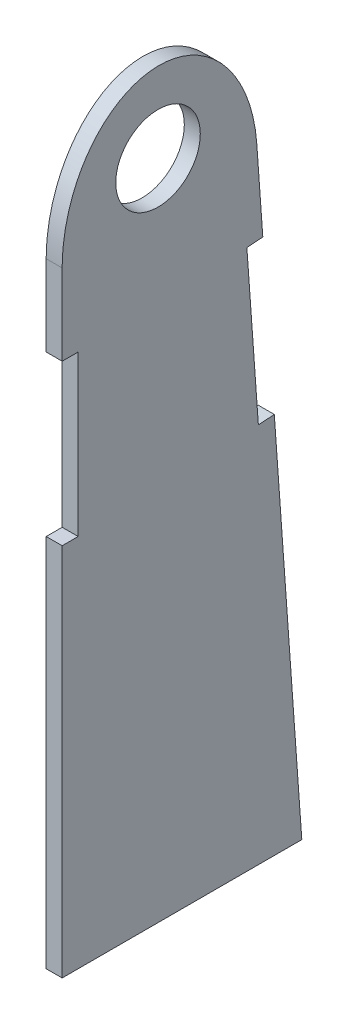
ISO-10303-21;
HEADER;
FILE_DESCRIPTION(('STEP AP214'),'2;1');
FILE_NAME('part.step','',(''),(''),'','','');
FILE_SCHEMA(('AUTOMOTIVE_DESIGN { 1 0 10303 214 1 1 1 1 }'));
ENDSEC;
DATA;
#1=APPLICATION_CONTEXT('core data for automotive mechanical design processes');
#2=APPLICATION_PROTOCOL_DEFINITION('international standard','automotive_design',2000,#1);
#3=PRODUCT_CONTEXT('',#1,'mechanical');
#4=PRODUCT('Part','Part','',(#3));
#5=PRODUCT_RELATED_PRODUCT_CATEGORY('part','',(#4));
#6=PRODUCT_DEFINITION_FORMATION('','',#4);
#7=PRODUCT_DEFINITION_CONTEXT('part definition',#1,'design');
#8=PRODUCT_DEFINITION('design','',#6,#7);
#9=PRODUCT_DEFINITION_SHAPE('','',#8);
#10=(LENGTH_UNIT() NAMED_UNIT(*) SI_UNIT(.MILLI.,.METRE.));
#11=(NAMED_UNIT(*) PLANE_ANGLE_UNIT() SI_UNIT($,.RADIAN.));
#12=(NAMED_UNIT(*) SI_UNIT($,.STERADIAN.) SOLID_ANGLE_UNIT());
#13=UNCERTAINTY_MEASURE_WITH_UNIT(LENGTH_MEASURE(1.E-05),#10,'distance_accuracy_value','');
#14=(GEOMETRIC_REPRESENTATION_CONTEXT(3) GLOBAL_UNCERTAINTY_ASSIGNED_CONTEXT((#13)) GLOBAL_UNIT_ASSIGNED_CONTEXT((#10,
#11,#12)) REPRESENTATION_CONTEXT('',''));
#15=CARTESIAN_POINT('',(0.,0.,0.));
#16=DIRECTION('',(0.,0.,1.));
#17=DIRECTION('',(1.,0.,0.));
#18=AXIS2_PLACEMENT_3D('',#15,#16,#17);
#19=CARTESIAN_POINT('',(1.5875,0.,0.));
#20=DIRECTION('',(1.,0.,0.));
#21=DIRECTION('',(0.,0.,-1.));
#22=AXIS2_PLACEMENT_3D('',#19,#20,#21);
#23=PLANE('',#22);
#24=CARTESIAN_POINT('',(1.5875,0.,0.));
#25=DIRECTION('',(1.,0.,0.));
#26=DIRECTION('',(0.,0.,-1.));
#27=AXIS2_PLACEMENT_3D('',#24,#25,#26);
#28=CIRCLE('',#27,4.2);
#29=CARTESIAN_POINT('',(1.5875,0.,-4.2));
#30=VERTEX_POINT('',#29);
#31=EDGE_CURVE('E240',#30,#30,#28,.T.);
#32=ORIENTED_EDGE('',*,*,#31,.F.);
#33=EDGE_LOOP('',(#32));
#34=FACE_BOUND('',#33,.T.);
#35=DIRECTION('',(0.,0.997415809527486,0.0718449922028656));
#36=VECTOR('',#35,1.);
#37=CARTESIAN_POINT('',(1.5875,0.684323550732295,-9.50038558574931));
#38=LINE('',#37,#36);
#39=CARTESIAN_POINT('',(1.5875,-11.9828572302668,-10.4128169867257));
#40=VERTEX_POINT('',#39);
#41=CARTESIAN_POINT('',(1.5875,-3.65835279360995,-9.81319348905159));
#42=VERTEX_POINT('',#41);
#43=EDGE_CURVE('E189',#40,#42,#38,.T.);
#44=ORIENTED_EDGE('',*,*,#43,.T.);
#45=CARTESIAN_POINT('',(1.5875,-4.7625,-0.165572585401585));
#46=DIRECTION('',(1.,0.,0.));
#47=DIRECTION('',(0.,0.999915026390816,0.0130361036300332));
#48=AXIS2_PLACEMENT_3D('',#45,#46,#47);
#49=ELLIPSE('',#48,12.701079256545,9.68998139284341);
#50=CARTESIAN_POINT('',(1.5875,-4.67180966686049,9.52500000000001));
#51=VERTEX_POINT('',#50);
#52=EDGE_CURVE('E248',#42,#51,#49,.T.);
#53=ORIENTED_EDGE('',*,*,#52,.T.);
#54=DIRECTION('',(0.,1.,0.));
#55=VECTOR('',#54,1.);
#56=CARTESIAN_POINT('',(1.5875,0.,9.525));
#57=LINE('',#56,#55);
#58=CARTESIAN_POINT('',(1.5875,-12.7,9.52500000000002));
#59=VERTEX_POINT('',#58);
#60=EDGE_CURVE('E226',#59,#51,#57,.T.);
#61=ORIENTED_EDGE('',*,*,#60,.F.);
#62=DIRECTION('',(0.,0.,-1.));
#63=VECTOR('',#62,1.);
#64=CARTESIAN_POINT('',(1.5875,-12.7,0.));
#65=LINE('',#64,#63);
#66=CARTESIAN_POINT('',(1.5875,-12.7,7.93750000000001));
#67=VERTEX_POINT('',#66);
#68=EDGE_CURVE('E222',#59,#67,#65,.T.);
#69=ORIENTED_EDGE('',*,*,#68,.T.);
#70=DIRECTION('',(0.,1.,0.));
#71=VECTOR('',#70,1.);
#72=CARTESIAN_POINT('',(1.5875,0.,7.93749999999998));
#73=LINE('',#72,#71);
#74=CARTESIAN_POINT('',(1.5875,-28.575,7.93750000000005));
#75=VERTEX_POINT('',#74);
#76=EDGE_CURVE('E206',#75,#67,#73,.T.);
#77=ORIENTED_EDGE('',*,*,#76,.F.);
#78=DIRECTION('',(0.,0.,-1.));
#79=VECTOR('',#78,1.);
#80=CARTESIAN_POINT('',(1.5875,-28.575,0.));
#81=LINE('',#80,#79);
#82=CARTESIAN_POINT('',(1.5875,-28.575,9.52500000000005));
#83=VERTEX_POINT('',#82);
#84=EDGE_CURVE('E218',#83,#75,#81,.T.);
#85=ORIENTED_EDGE('',*,*,#84,.F.);
#86=CARTESIAN_POINT('',(1.5875,-65.7746383391697,9.52500000000011));
#87=VERTEX_POINT('',#86);
#88=EDGE_CURVE('E224',#87,#83,#57,.T.);
#89=ORIENTED_EDGE('',*,*,#88,.F.);
#90=DIRECTION('',(0.,0.,1.));
#91=VECTOR('',#90,1.);
#92=CARTESIAN_POINT('',(1.5875,-65.7746383391697,0.));
#93=LINE('',#92,#91);
#94=CARTESIAN_POINT('',(1.5875,-65.7746383391697,-14.2875));
#95=VERTEX_POINT('',#94);
#96=EDGE_CURVE('E229',#95,#87,#93,.T.);
#97=ORIENTED_EDGE('',*,*,#96,.F.);
#98=CARTESIAN_POINT('',(1.5875,-27.8168332065156,-11.5533562379462));
#99=VERTEX_POINT('',#98);
#100=EDGE_CURVE('E141',#95,#99,#38,.T.);
#101=ORIENTED_EDGE('',*,*,#100,.T.);
#102=DIRECTION('',(0.,-0.0718449922028648,0.997415809527486));
#103=VECTOR('',#102,1.);
#104=CARTESIAN_POINT('',(1.5875,-28.5011567572479,-2.05297065219686));
#105=LINE('',#104,#103);
#106=CARTESIAN_POINT('',(1.5875,-27.9308871316377,-9.96995864032131));
#107=VERTEX_POINT('',#106);
#108=EDGE_CURVE('E132',#99,#107,#105,.T.);
#109=ORIENTED_EDGE('',*,*,#108,.T.);
#110=DIRECTION('',(0.,0.997415809527486,0.0718449922028657));
#111=VECTOR('',#110,1.);
#112=CARTESIAN_POINT('',(1.5875,0.570269625610247,-7.91698798812442));
#113=LINE('',#112,#111);
#114=CARTESIAN_POINT('',(1.5875,-12.0969111553888,-8.82941938910081));
#115=VERTEX_POINT('',#114);
#116=EDGE_CURVE('E137',#107,#115,#113,.T.);
#117=ORIENTED_EDGE('',*,*,#116,.T.);
#118=DIRECTION('',(0.,-0.0718449922028669,0.997415809527486));
#119=VECTOR('',#118,1.);
#120=CARTESIAN_POINT('',(1.5875,-12.6671807809991,-0.91243140097641));
#121=LINE('',#120,#119);
#122=EDGE_CURVE('E158',#40,#115,#121,.T.);
#123=ORIENTED_EDGE('',*,*,#122,.F.);
#124=EDGE_LOOP('',(#44,#53,#61,#69,#77,#85,#89,#97,#101,#109,#117,#123));
#125=FACE_BOUND('',#124,.T.);
#126=ADVANCED_FACE('F40',(#34,#125),#23,.T.);
#127=CARTESIAN_POINT('',(0.,0.,0.));
#128=DIRECTION('',(1.,0.,0.));
#129=DIRECTION('',(0.,0.,-1.));
#130=AXIS2_PLACEMENT_3D('',#127,#128,#129);
#131=PLANE('',#130);
#132=CARTESIAN_POINT('',(0.,0.,0.));
#133=DIRECTION('',(1.,0.,0.));
#134=DIRECTION('',(0.,0.,-1.));
#135=AXIS2_PLACEMENT_3D('',#132,#133,#134);
#136=CIRCLE('',#135,4.2);
#137=CARTESIAN_POINT('',(0.,0.,-4.2));
#138=VERTEX_POINT('',#137);
#139=EDGE_CURVE('E166',#138,#138,#136,.T.);
#140=ORIENTED_EDGE('',*,*,#139,.T.);
#141=EDGE_LOOP('',(#140));
#142=FACE_BOUND('',#141,.T.);
#143=CARTESIAN_POINT('',(0.,-4.7625,-0.165572585401585));
#144=DIRECTION('',(1.,0.,0.));
#145=DIRECTION('',(0.,0.999915026390816,0.0130361036300332));
#146=AXIS2_PLACEMENT_3D('',#143,#144,#145);
#147=ELLIPSE('',#146,12.701079256545,9.68998139284341);
#148=CARTESIAN_POINT('',(0.,-3.65835279360995,-9.81319348905159));
#149=VERTEX_POINT('',#148);
#150=CARTESIAN_POINT('',(0.,-4.67180966686049,9.52500000000001));
#151=VERTEX_POINT('',#150);
#152=EDGE_CURVE('E245',#149,#151,#147,.T.);
#153=ORIENTED_EDGE('',*,*,#152,.F.);
#154=DIRECTION('',(0.,0.997415809527486,0.0718449922028656));
#155=VECTOR('',#154,1.);
#156=CARTESIAN_POINT('',(0.,0.684323550732295,-9.50038558574931));
#157=LINE('',#156,#155);
#158=CARTESIAN_POINT('',(0.,-11.9828572302668,-10.4128169867257));
#159=VERTEX_POINT('',#158);
#160=EDGE_CURVE('E163',#159,#149,#157,.T.);
#161=ORIENTED_EDGE('',*,*,#160,.F.);
#162=DIRECTION('',(0.,-0.0718449922028669,0.997415809527486));
#163=VECTOR('',#162,1.);
#164=CARTESIAN_POINT('',(0.,-12.6671807809991,-0.91243140097641));
#165=LINE('',#164,#163);
#166=CARTESIAN_POINT('',(0.,-12.0969111553888,-8.82941938910081));
#167=VERTEX_POINT('',#166);
#168=EDGE_CURVE('E186',#159,#167,#165,.T.);
#169=ORIENTED_EDGE('',*,*,#168,.T.);
#170=DIRECTION('',(0.,0.997415809527486,0.0718449922028657));
#171=VECTOR('',#170,1.);
#172=CARTESIAN_POINT('',(0.,0.570269625610247,-7.91698798812442));
#173=LINE('',#172,#171);
#174=CARTESIAN_POINT('',(0.,-27.9308871316377,-9.96995864032131));
#175=VERTEX_POINT('',#174);
#176=EDGE_CURVE('E184',#175,#167,#173,.T.);
#177=ORIENTED_EDGE('',*,*,#176,.F.);
#178=DIRECTION('',(0.,-0.0718449922028648,0.997415809527486));
#179=VECTOR('',#178,1.);
#180=CARTESIAN_POINT('',(0.,-28.5011567572479,-2.05297065219686));
#181=LINE('',#180,#179);
#182=CARTESIAN_POINT('',(0.,-27.8168332065156,-11.5533562379462));
#183=VERTEX_POINT('',#182);
#184=EDGE_CURVE('E150',#183,#175,#181,.T.);
#185=ORIENTED_EDGE('',*,*,#184,.F.);
#186=CARTESIAN_POINT('',(0.,-65.7746383391697,-14.2875));
#187=VERTEX_POINT('',#186);
#188=EDGE_CURVE('E167',#187,#183,#157,.T.);
#189=ORIENTED_EDGE('',*,*,#188,.F.);
#190=DIRECTION('',(0.,0.,1.));
#191=VECTOR('',#190,1.);
#192=CARTESIAN_POINT('',(0.,-65.7746383391697,0.));
#193=LINE('',#192,#191);
#194=CARTESIAN_POINT('',(0.,-65.7746383391697,9.52500000000011));
#195=VERTEX_POINT('',#194);
#196=EDGE_CURVE('E180',#187,#195,#193,.T.);
#197=ORIENTED_EDGE('',*,*,#196,.T.);
#198=DIRECTION('',(0.,1.,0.));
#199=VECTOR('',#198,1.);
#200=CARTESIAN_POINT('',(0.,0.,9.525));
#201=LINE('',#200,#199);
#202=CARTESIAN_POINT('',(0.,-28.575,9.52500000000005));
#203=VERTEX_POINT('',#202);
#204=EDGE_CURVE('E171',#195,#203,#201,.T.);
#205=ORIENTED_EDGE('',*,*,#204,.T.);
#206=DIRECTION('',(0.,0.,-1.));
#207=VECTOR('',#206,1.);
#208=CARTESIAN_POINT('',(0.,-28.575,0.));
#209=LINE('',#208,#207);
#210=CARTESIAN_POINT('',(0.,-28.575,7.93750000000005));
#211=VERTEX_POINT('',#210);
#212=EDGE_CURVE('E177',#203,#211,#209,.T.);
#213=ORIENTED_EDGE('',*,*,#212,.T.);
#214=DIRECTION('',(0.,1.,0.));
#215=VECTOR('',#214,1.);
#216=CARTESIAN_POINT('',(0.,0.,7.93749999999998));
#217=LINE('',#216,#215);
#218=CARTESIAN_POINT('',(0.,-12.7,7.93750000000001));
#219=VERTEX_POINT('',#218);
#220=EDGE_CURVE('E174',#211,#219,#217,.T.);
#221=ORIENTED_EDGE('',*,*,#220,.T.);
#222=DIRECTION('',(0.,0.,-1.));
#223=VECTOR('',#222,1.);
#224=CARTESIAN_POINT('',(0.,-12.7,0.));
#225=LINE('',#224,#223);
#226=CARTESIAN_POINT('',(0.,-12.7,9.52500000000002));
#227=VERTEX_POINT('',#226);
#228=EDGE_CURVE('E170',#227,#219,#225,.T.);
#229=ORIENTED_EDGE('',*,*,#228,.F.);
#230=EDGE_CURVE('E165',#227,#151,#201,.T.);
#231=ORIENTED_EDGE('',*,*,#230,.T.);
#232=EDGE_LOOP('',(#153,#161,#169,#177,#185,#189,#197,#205,#213,#221,#229,#231));
#233=FACE_BOUND('',#232,.T.);
#234=ADVANCED_FACE('F210',(#142,#233),#131,.F.);
#235=CARTESIAN_POINT('',(1.5875,0.684323550732295,-9.50038558574931));
#236=DIRECTION('',(0.,-0.0718449922028656,0.997415809527486));
#237=DIRECTION('',(0.,-0.997415809527486,-0.0718449922028656));
#238=AXIS2_PLACEMENT_3D('',#235,#236,#237);
#239=PLANE('',#238);
#240=ORIENTED_EDGE('',*,*,#160,.T.);
#241=DIRECTION('',(1.,0.,0.));
#242=VECTOR('',#241,1.);
#243=CARTESIAN_POINT('',(0.,-3.65835279360995,-9.81319348905159));
#244=LINE('',#243,#242);
#245=EDGE_CURVE('E55',#149,#42,#244,.T.);
#246=ORIENTED_EDGE('',*,*,#245,.T.);
#247=ORIENTED_EDGE('',*,*,#43,.F.);
#248=DIRECTION('',(-1.,0.,0.));
#249=VECTOR('',#248,1.);
#250=CARTESIAN_POINT('',(1.5875,-11.9828572302668,-10.4128169867257));
#251=LINE('',#250,#249);
#252=EDGE_CURVE('E64',#40,#159,#251,.T.);
#253=ORIENTED_EDGE('',*,*,#252,.T.);
#254=EDGE_LOOP('',(#240,#246,#247,#253));
#255=FACE_BOUND('',#254,.T.);
#256=ADVANCED_FACE('F265',(#255),#239,.F.);
#257=CARTESIAN_POINT('',(1.5875,0.,9.525));
#258=DIRECTION('',(0.,0.,1.));
#259=DIRECTION('',(0.,-1.,0.));
#260=AXIS2_PLACEMENT_3D('',#257,#258,#259);
#261=PLANE('',#260);
#262=DIRECTION('',(1.,0.,0.));
#263=VECTOR('',#262,1.);
#264=CARTESIAN_POINT('',(0.,-4.67180966686049,9.52500000000001));
#265=LINE('',#264,#263);
#266=EDGE_CURVE('E243',#151,#51,#265,.T.);
#267=ORIENTED_EDGE('',*,*,#266,.F.);
#268=ORIENTED_EDGE('',*,*,#230,.F.);
#269=DIRECTION('',(-1.,0.,0.));
#270=VECTOR('',#269,1.);
#271=CARTESIAN_POINT('',(1.5875,-12.7,9.52500000000002));
#272=LINE('',#271,#270);
#273=EDGE_CURVE('E11',#59,#227,#272,.T.);
#274=ORIENTED_EDGE('',*,*,#273,.F.);
#275=ORIENTED_EDGE('',*,*,#60,.T.);
#276=EDGE_LOOP('',(#267,#268,#274,#275));
#277=FACE_BOUND('',#276,.T.);
#278=ADVANCED_FACE('F283',(#277),#261,.T.);
#279=CARTESIAN_POINT('',(1.5875,-12.7,0.));
#280=DIRECTION('',(0.,1.,0.));
#281=DIRECTION('',(0.,0.,1.));
#282=AXIS2_PLACEMENT_3D('',#279,#280,#281);
#283=PLANE('',#282);
#284=ORIENTED_EDGE('',*,*,#228,.T.);
#285=DIRECTION('',(-1.,0.,0.));
#286=VECTOR('',#285,1.);
#287=CARTESIAN_POINT('',(1.5875,-12.7,7.93750000000001));
#288=LINE('',#287,#286);
#289=EDGE_CURVE('E48',#67,#219,#288,.T.);
#290=ORIENTED_EDGE('',*,*,#289,.F.);
#291=ORIENTED_EDGE('',*,*,#68,.F.);
#292=ORIENTED_EDGE('',*,*,#273,.T.);
#293=EDGE_LOOP('',(#284,#290,#291,#292));
#294=FACE_BOUND('',#293,.T.);
#295=ADVANCED_FACE('F42',(#294),#283,.F.);
#296=CARTESIAN_POINT('',(1.5875,0.,7.93749999999998));
#297=DIRECTION('',(0.,0.,1.));
#298=DIRECTION('',(0.,-1.,0.));
#299=AXIS2_PLACEMENT_3D('',#296,#297,#298);
#300=PLANE('',#299);
#301=ORIENTED_EDGE('',*,*,#220,.F.);
#302=DIRECTION('',(-1.,0.,0.));
#303=VECTOR('',#302,1.);
#304=CARTESIAN_POINT('',(1.5875,-28.575,7.93750000000005));
#305=LINE('',#304,#303);
#306=EDGE_CURVE('E199',#75,#211,#305,.T.);
#307=ORIENTED_EDGE('',*,*,#306,.F.);
#308=ORIENTED_EDGE('',*,*,#76,.T.);
#309=ORIENTED_EDGE('',*,*,#289,.T.);
#310=EDGE_LOOP('',(#301,#307,#308,#309));
#311=FACE_BOUND('',#310,.T.);
#312=ADVANCED_FACE('F204',(#311),#300,.T.);
#313=CARTESIAN_POINT('',(1.5875,-28.575,0.));
#314=DIRECTION('',(0.,1.,0.));
#315=DIRECTION('',(0.,0.,1.));
#316=AXIS2_PLACEMENT_3D('',#313,#314,#315);
#317=PLANE('',#316);
#318=ORIENTED_EDGE('',*,*,#212,.F.);
#319=DIRECTION('',(-1.,0.,0.));
#320=VECTOR('',#319,1.);
#321=CARTESIAN_POINT('',(1.5875,-28.575,9.52500000000005));
#322=LINE('',#321,#320);
#323=EDGE_CURVE('E197',#83,#203,#322,.T.);
#324=ORIENTED_EDGE('',*,*,#323,.F.);
#325=ORIENTED_EDGE('',*,*,#84,.T.);
#326=ORIENTED_EDGE('',*,*,#306,.T.);
#327=EDGE_LOOP('',(#318,#324,#325,#326));
#328=FACE_BOUND('',#327,.T.);
#329=ADVANCED_FACE('F215',(#328),#317,.T.);
#330=ORIENTED_EDGE('',*,*,#204,.F.);
#331=DIRECTION('',(-1.,0.,0.));
#332=VECTOR('',#331,1.);
#333=CARTESIAN_POINT('',(1.5875,-65.7746383391697,9.52500000000011));
#334=LINE('',#333,#332);
#335=EDGE_CURVE('E195',#87,#195,#334,.T.);
#336=ORIENTED_EDGE('',*,*,#335,.F.);
#337=ORIENTED_EDGE('',*,*,#88,.T.);
#338=ORIENTED_EDGE('',*,*,#323,.T.);
#339=EDGE_LOOP('',(#330,#336,#337,#338));
#340=FACE_BOUND('',#339,.T.);
#341=ADVANCED_FACE('F280',(#340),#261,.T.);
#342=CARTESIAN_POINT('',(1.5875,-65.7746383391697,0.));
#343=DIRECTION('',(0.,-1.,0.));
#344=DIRECTION('',(0.,0.,-1.));
#345=AXIS2_PLACEMENT_3D('',#342,#343,#344);
#346=PLANE('',#345);
#347=ORIENTED_EDGE('',*,*,#196,.F.);
#348=DIRECTION('',(-1.,0.,0.));
#349=VECTOR('',#348,1.);
#350=CARTESIAN_POINT('',(1.5875,-65.7746383391697,-14.2875));
#351=LINE('',#350,#349);
#352=EDGE_CURVE('E193',#95,#187,#351,.T.);
#353=ORIENTED_EDGE('',*,*,#352,.F.);
#354=ORIENTED_EDGE('',*,*,#96,.T.);
#355=ORIENTED_EDGE('',*,*,#335,.T.);
#356=EDGE_LOOP('',(#347,#353,#354,#355));
#357=FACE_BOUND('',#356,.T.);
#358=ADVANCED_FACE('F276',(#357),#346,.T.);
#359=ORIENTED_EDGE('',*,*,#188,.T.);
#360=DIRECTION('',(-1.,0.,0.));
#361=VECTOR('',#360,1.);
#362=CARTESIAN_POINT('',(1.5875,-27.8168332065156,-11.5533562379462));
#363=LINE('',#362,#361);
#364=EDGE_CURVE('E154',#99,#183,#363,.T.);
#365=ORIENTED_EDGE('',*,*,#364,.F.);
#366=ORIENTED_EDGE('',*,*,#100,.F.);
#367=ORIENTED_EDGE('',*,*,#352,.T.);
#368=EDGE_LOOP('',(#359,#365,#366,#367));
#369=FACE_BOUND('',#368,.T.);
#370=ADVANCED_FACE('F273',(#369),#239,.F.);
#371=CARTESIAN_POINT('',(1.5875,-28.5011567572479,-2.05297065219686));
#372=DIRECTION('',(0.,-0.997415809527486,-0.0718449922028647));
#373=DIRECTION('',(0.,0.0718449922028648,-0.997415809527486));
#374=AXIS2_PLACEMENT_3D('',#371,#372,#373);
#375=PLANE('',#374);
#376=ORIENTED_EDGE('',*,*,#184,.T.);
#377=DIRECTION('',(-1.,0.,0.));
#378=VECTOR('',#377,1.);
#379=CARTESIAN_POINT('',(1.5875,-27.9308871316377,-9.96995864032131));
#380=LINE('',#379,#378);
#381=EDGE_CURVE('E147',#107,#175,#380,.T.);
#382=ORIENTED_EDGE('',*,*,#381,.F.);
#383=ORIENTED_EDGE('',*,*,#108,.F.);
#384=ORIENTED_EDGE('',*,*,#364,.T.);
#385=EDGE_LOOP('',(#376,#382,#383,#384));
#386=FACE_BOUND('',#385,.T.);
#387=ADVANCED_FACE('F148',(#386),#375,.F.);
#388=CARTESIAN_POINT('',(1.5875,0.570269625610247,-7.91698798812442));
#389=DIRECTION('',(0.,-0.0718449922028657,0.997415809527486));
#390=DIRECTION('',(0.,-0.997415809527486,-0.0718449922028657));
#391=AXIS2_PLACEMENT_3D('',#388,#389,#390);
#392=PLANE('',#391);
#393=ORIENTED_EDGE('',*,*,#176,.T.);
#394=DIRECTION('',(-1.,0.,0.));
#395=VECTOR('',#394,1.);
#396=CARTESIAN_POINT('',(1.5875,-12.0969111553888,-8.82941938910081));
#397=LINE('',#396,#395);
#398=EDGE_CURVE('E155',#115,#167,#397,.T.);
#399=ORIENTED_EDGE('',*,*,#398,.F.);
#400=ORIENTED_EDGE('',*,*,#116,.F.);
#401=ORIENTED_EDGE('',*,*,#381,.T.);
#402=EDGE_LOOP('',(#393,#399,#400,#401));
#403=FACE_BOUND('',#402,.T.);
#404=ADVANCED_FACE('F157',(#403),#392,.F.);
#405=CARTESIAN_POINT('',(1.5875,-12.6671807809991,-0.91243140097641));
#406=DIRECTION('',(0.,-0.997415809527486,-0.0718449922028669));
#407=DIRECTION('',(0.,0.0718449922028669,-0.997415809527486));
#408=AXIS2_PLACEMENT_3D('',#405,#406,#407);
#409=PLANE('',#408);
#410=ORIENTED_EDGE('',*,*,#168,.F.);
#411=ORIENTED_EDGE('',*,*,#252,.F.);
#412=ORIENTED_EDGE('',*,*,#122,.T.);
#413=ORIENTED_EDGE('',*,*,#398,.T.);
#414=EDGE_LOOP('',(#410,#411,#412,#413));
#415=FACE_BOUND('',#414,.T.);
#416=ADVANCED_FACE('F258',(#415),#409,.T.);
#417=CARTESIAN_POINT('',(1.5875,0.,0.));
#418=DIRECTION('',(1.,0.,0.));
#419=DIRECTION('',(0.,0.,-1.));
#420=AXIS2_PLACEMENT_3D('',#417,#418,#419);
#421=CYLINDRICAL_SURFACE('',#420,4.2);
#422=ORIENTED_EDGE('',*,*,#139,.F.);
#423=EDGE_LOOP('',(#422));
#424=FACE_BOUND('',#423,.T.);
#425=ORIENTED_EDGE('',*,*,#31,.T.);
#426=EDGE_LOOP('',(#425));
#427=FACE_BOUND('',#426,.T.);
#428=ADVANCED_FACE('F255',(#424,#427),#421,.F.);
#429=DIRECTION('',(1.,0.,0.));
#430=VECTOR('',#429,1.);
#431=SURFACE_OF_LINEAR_EXTRUSION('',#147,#430);
#432=ORIENTED_EDGE('',*,*,#52,.F.);
#433=ORIENTED_EDGE('',*,*,#245,.F.);
#434=ORIENTED_EDGE('',*,*,#152,.T.);
#435=ORIENTED_EDGE('',*,*,#266,.T.);
#436=EDGE_LOOP('',(#432,#433,#434,#435));
#437=FACE_BOUND('',#436,.T.);
#438=ADVANCED_FACE('F252',(#437),#431,.T.);
#439=CLOSED_SHELL('',(#126,#234,#256,#278,#295,#312,#329,#341,#358,#370,#387,#404,#416,#428,#438));
#440=MANIFOLD_SOLID_BREP('B2',#439);
#441=ADVANCED_BREP_SHAPE_REPRESENTATION('',(#18,#440),#14);
#442=SHAPE_DEFINITION_REPRESENTATION(#9,#441);
ENDSEC;
END-ISO-10303-21;
